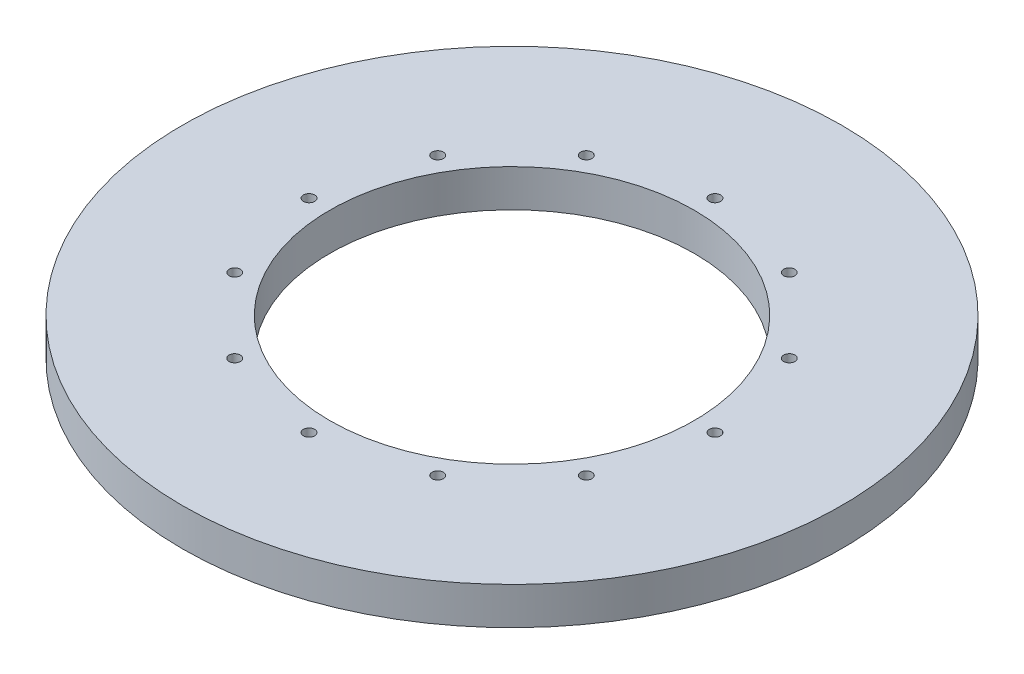
ISO-10303-21;
HEADER;
FILE_DESCRIPTION(('STEP AP214'),'2;1');
FILE_NAME('part.step','',(''),(''),'','','');
FILE_SCHEMA(('AUTOMOTIVE_DESIGN { 1 0 10303 214 1 1 1 1 }'));
ENDSEC;
DATA;
#1=APPLICATION_CONTEXT('core data for automotive mechanical design processes');
#2=APPLICATION_PROTOCOL_DEFINITION('international standard','automotive_design',2000,#1);
#3=PRODUCT_CONTEXT('',#1,'mechanical');
#4=PRODUCT('Part','Part','',(#3));
#5=PRODUCT_RELATED_PRODUCT_CATEGORY('part','',(#4));
#6=PRODUCT_DEFINITION_FORMATION('','',#4);
#7=PRODUCT_DEFINITION_CONTEXT('part definition',#1,'design');
#8=PRODUCT_DEFINITION('design','',#6,#7);
#9=PRODUCT_DEFINITION_SHAPE('','',#8);
#10=(LENGTH_UNIT() NAMED_UNIT(*) SI_UNIT(.MILLI.,.METRE.));
#11=(NAMED_UNIT(*) PLANE_ANGLE_UNIT() SI_UNIT($,.RADIAN.));
#12=(NAMED_UNIT(*) SI_UNIT($,.STERADIAN.) SOLID_ANGLE_UNIT());
#13=UNCERTAINTY_MEASURE_WITH_UNIT(LENGTH_MEASURE(1.E-05),#10,'distance_accuracy_value','');
#14=(GEOMETRIC_REPRESENTATION_CONTEXT(3) GLOBAL_UNCERTAINTY_ASSIGNED_CONTEXT((#13)) GLOBAL_UNIT_ASSIGNED_CONTEXT((#10,
#11,#12)) REPRESENTATION_CONTEXT('',''));
#15=CARTESIAN_POINT('',(0.,0.,0.));
#16=DIRECTION('',(0.,0.,1.));
#17=DIRECTION('',(1.,0.,0.));
#18=AXIS2_PLACEMENT_3D('',#15,#16,#17);
#19=CARTESIAN_POINT('',(0.,9.525,0.));
#20=DIRECTION('',(0.,-1.,0.));
#21=DIRECTION('',(0.,0.,-1.));
#22=AXIS2_PLACEMENT_3D('',#19,#20,#21);
#23=PLANE('',#22);
#24=CARTESIAN_POINT('',(19.1085055169264,9.525,-89.6302499999999));
#25=DIRECTION('',(0.,1.,0.));
#26=DIRECTION('',(0.86602540378444,0.,0.499999999999998));
#27=AXIS2_PLACEMENT_3D('',#24,#25,#26);
#28=CIRCLE('',#27,1.4351);
#29=CARTESIAN_POINT('',(20.3513385738974,9.525,-88.9126999999999));
#30=VERTEX_POINT('',#29);
#31=EDGE_CURVE('E118',#30,#30,#28,.T.);
#32=ORIENTED_EDGE('',*,*,#31,.F.);
#33=EDGE_LOOP('',(#32));
#34=FACE_BOUND('',#33,.T.);
#35=CARTESIAN_POINT('',(12.192,9.525,-63.8174999999998));
#36=DIRECTION('',(0.,1.,0.));
#37=DIRECTION('',(1.,0.,0.));
#38=AXIS2_PLACEMENT_3D('',#35,#36,#37);
#39=CIRCLE('',#38,1.4351);
#40=CARTESIAN_POINT('',(13.6271,9.525,-63.8174999999998));
#41=VERTEX_POINT('',#40);
#42=EDGE_CURVE('E112',#41,#41,#39,.T.);
#43=ORIENTED_EDGE('',*,*,#42,.F.);
#44=EDGE_LOOP('',(#43));
#45=FACE_BOUND('',#44,.T.);
#46=CARTESIAN_POINT('',(19.1085055169266,9.525,-38.0047499999998));
#47=DIRECTION('',(0.,1.,0.));
#48=DIRECTION('',(0.866025403784436,0.,-0.500000000000004));
#49=AXIS2_PLACEMENT_3D('',#46,#47,#48);
#50=CIRCLE('',#49,1.4351);
#51=CARTESIAN_POINT('',(20.3513385738976,9.525,-38.7222999999998));
#52=VERTEX_POINT('',#51);
#53=EDGE_CURVE('E106',#52,#52,#50,.T.);
#54=ORIENTED_EDGE('',*,*,#53,.F.);
#55=EDGE_LOOP('',(#54));
#56=FACE_BOUND('',#55,.T.);
#57=CARTESIAN_POINT('',(38.0047500000003,9.525,-19.1085055169263));
#58=DIRECTION('',(0.,1.,0.));
#59=DIRECTION('',(0.499999999999995,0.,-0.866025403784442));
#60=AXIS2_PLACEMENT_3D('',#57,#58,#59);
#61=CIRCLE('',#60,1.4351);
#62=CARTESIAN_POINT('',(38.7223000000002,9.525,-20.3513385738974));
#63=VERTEX_POINT('',#62);
#64=EDGE_CURVE('E100',#63,#63,#61,.T.);
#65=ORIENTED_EDGE('',*,*,#64,.F.);
#66=EDGE_LOOP('',(#65));
#67=FACE_BOUND('',#66,.T.);
#68=CARTESIAN_POINT('',(63.8175,9.525,-12.192));
#69=DIRECTION('',(0.,1.,0.));
#70=DIRECTION('',(0.,0.,-1.));
#71=AXIS2_PLACEMENT_3D('',#68,#69,#70);
#72=CIRCLE('',#71,1.4351);
#73=CARTESIAN_POINT('',(63.8175,9.525,-13.6271));
#74=VERTEX_POINT('',#73);
#75=EDGE_CURVE('E94',#74,#74,#72,.T.);
#76=ORIENTED_EDGE('',*,*,#75,.F.);
#77=EDGE_LOOP('',(#76));
#78=FACE_BOUND('',#77,.T.);
#79=CARTESIAN_POINT('',(89.6302500000004,9.525,-19.1085055169267));
#80=DIRECTION('',(0.,1.,0.));
#81=DIRECTION('',(-0.500000000000007,0.,-0.866025403784435));
#82=AXIS2_PLACEMENT_3D('',#79,#80,#81);
#83=CIRCLE('',#82,1.4351);
#84=CARTESIAN_POINT('',(88.9127000000003,9.525,-20.3513385738977));
#85=VERTEX_POINT('',#84);
#86=EDGE_CURVE('E88',#85,#85,#83,.T.);
#87=ORIENTED_EDGE('',*,*,#86,.F.);
#88=EDGE_LOOP('',(#87));
#89=FACE_BOUND('',#88,.T.);
#90=CARTESIAN_POINT('',(108.526494483074,9.525,-38.0047500000004));
#91=DIRECTION('',(0.,1.,0.));
#92=DIRECTION('',(-0.866025403784443,0.,-0.499999999999992));
#93=AXIS2_PLACEMENT_3D('',#90,#91,#92);
#94=CIRCLE('',#93,1.4351);
#95=CARTESIAN_POINT('',(107.283661426103,9.525,-38.7223000000004));
#96=VERTEX_POINT('',#95);
#97=EDGE_CURVE('E82',#96,#96,#94,.T.);
#98=ORIENTED_EDGE('',*,*,#97,.F.);
#99=EDGE_LOOP('',(#98));
#100=FACE_BOUND('',#99,.T.);
#101=CARTESIAN_POINT('',(115.443,9.525,-63.8175000000006));
#102=DIRECTION('',(0.,1.,0.));
#103=DIRECTION('',(-1.,0.,0.));
#104=AXIS2_PLACEMENT_3D('',#101,#102,#103);
#105=CIRCLE('',#104,1.4351);
#106=CARTESIAN_POINT('',(114.0079,9.525,-63.8175000000005));
#107=VERTEX_POINT('',#106);
#108=EDGE_CURVE('E75',#107,#107,#105,.T.);
#109=ORIENTED_EDGE('',*,*,#108,.F.);
#110=EDGE_LOOP('',(#109));
#111=FACE_BOUND('',#110,.T.);
#112=CARTESIAN_POINT('',(108.526494483073,9.525,-89.6302500000005));
#113=DIRECTION('',(0.,1.,0.));
#114=DIRECTION('',(-0.866025403784433,0.,0.50000000000001));
#115=AXIS2_PLACEMENT_3D('',#112,#113,#114);
#116=CIRCLE('',#115,1.4351);
#117=CARTESIAN_POINT('',(107.283661426102,9.525,-88.9127000000005));
#118=VERTEX_POINT('',#117);
#119=EDGE_CURVE('E129',#118,#118,#116,.T.);
#120=ORIENTED_EDGE('',*,*,#119,.F.);
#121=EDGE_LOOP('',(#120));
#122=FACE_BOUND('',#121,.T.);
#123=CARTESIAN_POINT('',(89.6302499999994,9.525,-108.526494483074));
#124=DIRECTION('',(0.,1.,0.));
#125=DIRECTION('',(-0.499999999999989,0.,0.866025403784445));
#126=AXIS2_PLACEMENT_3D('',#123,#124,#125);
#127=CIRCLE('',#126,1.4351);
#128=CARTESIAN_POINT('',(88.9126999999994,9.525,-107.283661426103));
#129=VERTEX_POINT('',#128);
#130=EDGE_CURVE('E123',#129,#129,#127,.T.);
#131=ORIENTED_EDGE('',*,*,#130,.F.);
#132=EDGE_LOOP('',(#131));
#133=FACE_BOUND('',#132,.T.);
#134=CARTESIAN_POINT('',(38.0047499999999,9.525,-108.526494483073));
#135=DIRECTION('',(0.,1.,0.));
#136=DIRECTION('',(0.500000000000001,0.,0.866025403784438));
#137=AXIS2_PLACEMENT_3D('',#134,#135,#136);
#138=CIRCLE('',#137,1.4351);
#139=CARTESIAN_POINT('',(38.7222999999999,9.525,-107.283661426102));
#140=VERTEX_POINT('',#139);
#141=EDGE_CURVE('E69',#140,#140,#138,.T.);
#142=ORIENTED_EDGE('',*,*,#141,.F.);
#143=EDGE_LOOP('',(#142));
#144=FACE_BOUND('',#143,.T.);
#145=CARTESIAN_POINT('',(63.8175,9.525,-115.443));
#146=DIRECTION('',(0.,1.,0.));
#147=DIRECTION('',(0.,0.,1.));
#148=AXIS2_PLACEMENT_3D('',#145,#146,#147);
#149=CIRCLE('',#148,1.4351);
#150=CARTESIAN_POINT('',(63.8175,9.525,-114.0079));
#151=VERTEX_POINT('',#150);
#152=EDGE_CURVE('E63',#151,#151,#149,.T.);
#153=ORIENTED_EDGE('',*,*,#152,.F.);
#154=EDGE_LOOP('',(#153));
#155=FACE_BOUND('',#154,.T.);
#156=CARTESIAN_POINT('',(63.8175,9.525,-63.8175));
#157=DIRECTION('',(0.,1.,0.));
#158=DIRECTION('',(0.,0.,1.));
#159=AXIS2_PLACEMENT_3D('',#156,#157,#158);
#160=CIRCLE('',#159,46.355);
#161=CARTESIAN_POINT('',(63.8175,9.525,-17.4625));
#162=VERTEX_POINT('',#161);
#163=EDGE_CURVE('E57',#162,#162,#160,.T.);
#164=ORIENTED_EDGE('',*,*,#163,.F.);
#165=EDGE_LOOP('',(#164));
#166=FACE_BOUND('',#165,.T.);
#167=CARTESIAN_POINT('',(63.8175,9.52500000000001,-63.8175));
#168=DIRECTION('',(0.,-1.,0.));
#169=DIRECTION('',(0.,0.,-1.));
#170=AXIS2_PLACEMENT_3D('',#167,#168,#169);
#171=CIRCLE('',#170,83.82);
#172=CARTESIAN_POINT('',(63.8175,9.52500000000001,-147.6375));
#173=VERTEX_POINT('',#172);
#174=EDGE_CURVE('E11',#173,#173,#171,.F.);
#175=ORIENTED_EDGE('',*,*,#174,.T.);
#176=EDGE_LOOP('',(#175));
#177=FACE_BOUND('',#176,.T.);
#178=ADVANCED_FACE('F42',(#34,#45,#56,#67,#78,#89,#100,#111,#122,#133,#144,#155,#166,#177),#23,.F.);
#179=CARTESIAN_POINT('',(0.,0.,0.));
#180=DIRECTION('',(0.,-1.,0.));
#181=DIRECTION('',(0.,0.,-1.));
#182=AXIS2_PLACEMENT_3D('',#179,#180,#181);
#183=PLANE('',#182);
#184=CARTESIAN_POINT('',(19.1085055169264,0.,-89.6302499999999));
#185=DIRECTION('',(0.,1.,0.));
#186=DIRECTION('',(0.86602540378444,0.,0.499999999999998));
#187=AXIS2_PLACEMENT_3D('',#184,#185,#186);
#188=CIRCLE('',#187,1.4351);
#189=CARTESIAN_POINT('',(20.3513385738974,0.,-88.9126999999999));
#190=VERTEX_POINT('',#189);
#191=EDGE_CURVE('E72',#190,#190,#188,.T.);
#192=ORIENTED_EDGE('',*,*,#191,.T.);
#193=EDGE_LOOP('',(#192));
#194=FACE_BOUND('',#193,.T.);
#195=CARTESIAN_POINT('',(12.192,0.,-63.8174999999998));
#196=DIRECTION('',(0.,1.,0.));
#197=DIRECTION('',(1.,0.,0.));
#198=AXIS2_PLACEMENT_3D('',#195,#196,#197);
#199=CIRCLE('',#198,1.4351);
#200=CARTESIAN_POINT('',(13.6271,0.,-63.8174999999998));
#201=VERTEX_POINT('',#200);
#202=EDGE_CURVE('E115',#201,#201,#199,.T.);
#203=ORIENTED_EDGE('',*,*,#202,.T.);
#204=EDGE_LOOP('',(#203));
#205=FACE_BOUND('',#204,.T.);
#206=CARTESIAN_POINT('',(19.1085055169266,0.,-38.0047499999998));
#207=DIRECTION('',(0.,1.,0.));
#208=DIRECTION('',(0.866025403784436,0.,-0.500000000000004));
#209=AXIS2_PLACEMENT_3D('',#206,#207,#208);
#210=CIRCLE('',#209,1.4351);
#211=CARTESIAN_POINT('',(20.3513385738976,0.,-38.7222999999998));
#212=VERTEX_POINT('',#211);
#213=EDGE_CURVE('E109',#212,#212,#210,.T.);
#214=ORIENTED_EDGE('',*,*,#213,.T.);
#215=EDGE_LOOP('',(#214));
#216=FACE_BOUND('',#215,.T.);
#217=CARTESIAN_POINT('',(38.0047500000003,0.,-19.1085055169263));
#218=DIRECTION('',(0.,1.,0.));
#219=DIRECTION('',(0.499999999999995,0.,-0.866025403784442));
#220=AXIS2_PLACEMENT_3D('',#217,#218,#219);
#221=CIRCLE('',#220,1.4351);
#222=CARTESIAN_POINT('',(38.7223000000002,0.,-20.3513385738974));
#223=VERTEX_POINT('',#222);
#224=EDGE_CURVE('E103',#223,#223,#221,.T.);
#225=ORIENTED_EDGE('',*,*,#224,.T.);
#226=EDGE_LOOP('',(#225));
#227=FACE_BOUND('',#226,.T.);
#228=CARTESIAN_POINT('',(63.8175,0.,-12.192));
#229=DIRECTION('',(0.,1.,0.));
#230=DIRECTION('',(0.,0.,-1.));
#231=AXIS2_PLACEMENT_3D('',#228,#229,#230);
#232=CIRCLE('',#231,1.4351);
#233=CARTESIAN_POINT('',(63.8175,0.,-13.6271));
#234=VERTEX_POINT('',#233);
#235=EDGE_CURVE('E97',#234,#234,#232,.T.);
#236=ORIENTED_EDGE('',*,*,#235,.T.);
#237=EDGE_LOOP('',(#236));
#238=FACE_BOUND('',#237,.T.);
#239=CARTESIAN_POINT('',(89.6302500000004,0.,-19.1085055169267));
#240=DIRECTION('',(0.,1.,0.));
#241=DIRECTION('',(-0.500000000000007,0.,-0.866025403784435));
#242=AXIS2_PLACEMENT_3D('',#239,#240,#241);
#243=CIRCLE('',#242,1.4351);
#244=CARTESIAN_POINT('',(88.9127000000003,0.,-20.3513385738977));
#245=VERTEX_POINT('',#244);
#246=EDGE_CURVE('E91',#245,#245,#243,.T.);
#247=ORIENTED_EDGE('',*,*,#246,.T.);
#248=EDGE_LOOP('',(#247));
#249=FACE_BOUND('',#248,.T.);
#250=CARTESIAN_POINT('',(108.526494483074,0.,-38.0047500000004));
#251=DIRECTION('',(0.,1.,0.));
#252=DIRECTION('',(-0.866025403784443,0.,-0.499999999999992));
#253=AXIS2_PLACEMENT_3D('',#250,#251,#252);
#254=CIRCLE('',#253,1.4351);
#255=CARTESIAN_POINT('',(107.283661426103,0.,-38.7223000000004));
#256=VERTEX_POINT('',#255);
#257=EDGE_CURVE('E85',#256,#256,#254,.T.);
#258=ORIENTED_EDGE('',*,*,#257,.T.);
#259=EDGE_LOOP('',(#258));
#260=FACE_BOUND('',#259,.T.);
#261=CARTESIAN_POINT('',(115.443,0.,-63.8175000000006));
#262=DIRECTION('',(0.,1.,0.));
#263=DIRECTION('',(-1.,0.,0.));
#264=AXIS2_PLACEMENT_3D('',#261,#262,#263);
#265=CIRCLE('',#264,1.4351);
#266=CARTESIAN_POINT('',(114.0079,0.,-63.8175000000005));
#267=VERTEX_POINT('',#266);
#268=EDGE_CURVE('E78',#267,#267,#265,.T.);
#269=ORIENTED_EDGE('',*,*,#268,.T.);
#270=EDGE_LOOP('',(#269));
#271=FACE_BOUND('',#270,.T.);
#272=CARTESIAN_POINT('',(108.526494483073,0.,-89.6302500000005));
#273=DIRECTION('',(0.,1.,0.));
#274=DIRECTION('',(-0.866025403784433,0.,0.50000000000001));
#275=AXIS2_PLACEMENT_3D('',#272,#273,#274);
#276=CIRCLE('',#275,1.4351);
#277=CARTESIAN_POINT('',(107.283661426102,0.,-88.9127000000005));
#278=VERTEX_POINT('',#277);
#279=EDGE_CURVE('E79',#278,#278,#276,.T.);
#280=ORIENTED_EDGE('',*,*,#279,.T.);
#281=EDGE_LOOP('',(#280));
#282=FACE_BOUND('',#281,.T.);
#283=CARTESIAN_POINT('',(89.6302499999994,0.,-108.526494483074));
#284=DIRECTION('',(0.,1.,0.));
#285=DIRECTION('',(-0.499999999999989,0.,0.866025403784445));
#286=AXIS2_PLACEMENT_3D('',#283,#284,#285);
#287=CIRCLE('',#286,1.4351);
#288=CARTESIAN_POINT('',(88.9126999999994,0.,-107.283661426103));
#289=VERTEX_POINT('',#288);
#290=EDGE_CURVE('E126',#289,#289,#287,.T.);
#291=ORIENTED_EDGE('',*,*,#290,.T.);
#292=EDGE_LOOP('',(#291));
#293=FACE_BOUND('',#292,.T.);
#294=CARTESIAN_POINT('',(38.0047499999999,0.,-108.526494483073));
#295=DIRECTION('',(0.,1.,0.));
#296=DIRECTION('',(0.500000000000001,0.,0.866025403784438));
#297=AXIS2_PLACEMENT_3D('',#294,#295,#296);
#298=CIRCLE('',#297,1.4351);
#299=CARTESIAN_POINT('',(38.7222999999999,0.,-107.283661426102));
#300=VERTEX_POINT('',#299);
#301=EDGE_CURVE('E66',#300,#300,#298,.T.);
#302=ORIENTED_EDGE('',*,*,#301,.T.);
#303=EDGE_LOOP('',(#302));
#304=FACE_BOUND('',#303,.T.);
#305=CARTESIAN_POINT('',(63.8175,0.,-115.443));
#306=DIRECTION('',(0.,1.,0.));
#307=DIRECTION('',(0.,0.,1.));
#308=AXIS2_PLACEMENT_3D('',#305,#306,#307);
#309=CIRCLE('',#308,1.4351);
#310=CARTESIAN_POINT('',(63.8175,0.,-114.0079));
#311=VERTEX_POINT('',#310);
#312=EDGE_CURVE('E61',#311,#311,#309,.T.);
#313=ORIENTED_EDGE('',*,*,#312,.T.);
#314=EDGE_LOOP('',(#313));
#315=FACE_BOUND('',#314,.T.);
#316=CARTESIAN_POINT('',(63.8175,0.,-63.8175));
#317=DIRECTION('',(0.,1.,0.));
#318=DIRECTION('',(0.,0.,1.));
#319=AXIS2_PLACEMENT_3D('',#316,#317,#318);
#320=CIRCLE('',#319,46.355);
#321=CARTESIAN_POINT('',(63.8175,0.,-17.4625));
#322=VERTEX_POINT('',#321);
#323=EDGE_CURVE('E53',#322,#322,#320,.T.);
#324=ORIENTED_EDGE('',*,*,#323,.T.);
#325=EDGE_LOOP('',(#324));
#326=FACE_BOUND('',#325,.T.);
#327=CARTESIAN_POINT('',(63.8175,0.,-63.8175));
#328=DIRECTION('',(0.,-1.,0.));
#329=DIRECTION('',(0.,0.,-1.));
#330=AXIS2_PLACEMENT_3D('',#327,#328,#329);
#331=CIRCLE('',#330,83.82);
#332=CARTESIAN_POINT('',(63.8175,0.,-147.6375));
#333=VERTEX_POINT('',#332);
#334=EDGE_CURVE('E49',#333,#333,#331,.T.);
#335=ORIENTED_EDGE('',*,*,#334,.T.);
#336=EDGE_LOOP('',(#335));
#337=FACE_BOUND('',#336,.T.);
#338=ADVANCED_FACE('F44',(#194,#205,#216,#227,#238,#249,#260,#271,#282,#293,#304,#315,#326,
#337),#183,.T.);
#339=CARTESIAN_POINT('',(63.8175,246.603761596226,-63.8175));
#340=DIRECTION('',(0.,-1.,0.));
#341=DIRECTION('',(0.,0.,-1.));
#342=AXIS2_PLACEMENT_3D('',#339,#340,#341);
#343=CYLINDRICAL_SURFACE('',#342,83.82);
#344=ORIENTED_EDGE('',*,*,#334,.F.);
#345=EDGE_LOOP('',(#344));
#346=FACE_BOUND('',#345,.T.);
#347=ORIENTED_EDGE('',*,*,#174,.F.);
#348=EDGE_LOOP('',(#347));
#349=FACE_BOUND('',#348,.T.);
#350=ADVANCED_FACE('F159',(#346,#349),#343,.T.);
#351=CARTESIAN_POINT('',(63.8175,0.,-63.8175));
#352=DIRECTION('',(0.,1.,0.));
#353=DIRECTION('',(0.,0.,1.));
#354=AXIS2_PLACEMENT_3D('',#351,#352,#353);
#355=CYLINDRICAL_SURFACE('',#354,46.355);
#356=ORIENTED_EDGE('',*,*,#323,.F.);
#357=EDGE_LOOP('',(#356));
#358=FACE_BOUND('',#357,.T.);
#359=ORIENTED_EDGE('',*,*,#163,.T.);
#360=EDGE_LOOP('',(#359));
#361=FACE_BOUND('',#360,.T.);
#362=ADVANCED_FACE('F156',(#358,#361),#355,.F.);
#363=CARTESIAN_POINT('',(63.8175,0.,-115.443));
#364=DIRECTION('',(0.,1.,0.));
#365=DIRECTION('',(0.,0.,1.));
#366=AXIS2_PLACEMENT_3D('',#363,#364,#365);
#367=CYLINDRICAL_SURFACE('',#366,1.4351);
#368=ORIENTED_EDGE('',*,*,#312,.F.);
#369=EDGE_LOOP('',(#368));
#370=FACE_BOUND('',#369,.T.);
#371=ORIENTED_EDGE('',*,*,#152,.T.);
#372=EDGE_LOOP('',(#371));
#373=FACE_BOUND('',#372,.T.);
#374=ADVANCED_FACE('F158',(#370,#373),#367,.F.);
#375=CARTESIAN_POINT('',(38.0047499999999,0.,-108.526494483073));
#376=DIRECTION('',(0.,1.,0.));
#377=DIRECTION('',(0.,0.,1.));
#378=AXIS2_PLACEMENT_3D('',#375,#376,#377);
#379=CYLINDRICAL_SURFACE('',#378,1.4351);
#380=ORIENTED_EDGE('',*,*,#301,.F.);
#381=EDGE_LOOP('',(#380));
#382=FACE_BOUND('',#381,.T.);
#383=ORIENTED_EDGE('',*,*,#141,.T.);
#384=EDGE_LOOP('',(#383));
#385=FACE_BOUND('',#384,.T.);
#386=ADVANCED_FACE('F166',(#382,#385),#379,.F.);
#387=CARTESIAN_POINT('',(89.6302499999994,0.,-108.526494483074));
#388=DIRECTION('',(0.,1.,0.));
#389=DIRECTION('',(0.,0.,1.));
#390=AXIS2_PLACEMENT_3D('',#387,#388,#389);
#391=CYLINDRICAL_SURFACE('',#390,1.4351);
#392=ORIENTED_EDGE('',*,*,#290,.F.);
#393=EDGE_LOOP('',(#392));
#394=FACE_BOUND('',#393,.T.);
#395=ORIENTED_EDGE('',*,*,#130,.T.);
#396=EDGE_LOOP('',(#395));
#397=FACE_BOUND('',#396,.T.);
#398=ADVANCED_FACE('F141',(#394,#397),#391,.F.);
#399=CARTESIAN_POINT('',(108.526494483073,0.,-89.6302500000005));
#400=DIRECTION('',(0.,1.,0.));
#401=DIRECTION('',(0.,0.,1.));
#402=AXIS2_PLACEMENT_3D('',#399,#400,#401);
#403=CYLINDRICAL_SURFACE('',#402,1.4351);
#404=ORIENTED_EDGE('',*,*,#279,.F.);
#405=EDGE_LOOP('',(#404));
#406=FACE_BOUND('',#405,.T.);
#407=ORIENTED_EDGE('',*,*,#119,.T.);
#408=EDGE_LOOP('',(#407));
#409=FACE_BOUND('',#408,.T.);
#410=ADVANCED_FACE('F137',(#406,#409),#403,.F.);
#411=CARTESIAN_POINT('',(115.443,0.,-63.8175000000006));
#412=DIRECTION('',(0.,1.,0.));
#413=DIRECTION('',(0.,0.,1.));
#414=AXIS2_PLACEMENT_3D('',#411,#412,#413);
#415=CYLINDRICAL_SURFACE('',#414,1.4351);
#416=ORIENTED_EDGE('',*,*,#268,.F.);
#417=EDGE_LOOP('',(#416));
#418=FACE_BOUND('',#417,.T.);
#419=ORIENTED_EDGE('',*,*,#108,.T.);
#420=EDGE_LOOP('',(#419));
#421=FACE_BOUND('',#420,.T.);
#422=ADVANCED_FACE('F140',(#418,#421),#415,.F.);
#423=CARTESIAN_POINT('',(108.526494483074,0.,-38.0047500000004));
#424=DIRECTION('',(0.,1.,0.));
#425=DIRECTION('',(0.,0.,1.));
#426=AXIS2_PLACEMENT_3D('',#423,#424,#425);
#427=CYLINDRICAL_SURFACE('',#426,1.4351);
#428=ORIENTED_EDGE('',*,*,#257,.F.);
#429=EDGE_LOOP('',(#428));
#430=FACE_BOUND('',#429,.T.);
#431=ORIENTED_EDGE('',*,*,#97,.T.);
#432=EDGE_LOOP('',(#431));
#433=FACE_BOUND('',#432,.T.);
#434=ADVANCED_FACE('F178',(#430,#433),#427,.F.);
#435=CARTESIAN_POINT('',(89.6302500000004,0.,-19.1085055169267));
#436=DIRECTION('',(0.,1.,0.));
#437=DIRECTION('',(0.,0.,1.));
#438=AXIS2_PLACEMENT_3D('',#435,#436,#437);
#439=CYLINDRICAL_SURFACE('',#438,1.4351);
#440=ORIENTED_EDGE('',*,*,#246,.F.);
#441=EDGE_LOOP('',(#440));
#442=FACE_BOUND('',#441,.T.);
#443=ORIENTED_EDGE('',*,*,#86,.T.);
#444=EDGE_LOOP('',(#443));
#445=FACE_BOUND('',#444,.T.);
#446=ADVANCED_FACE('F182',(#442,#445),#439,.F.);
#447=CARTESIAN_POINT('',(63.8175,0.,-12.192));
#448=DIRECTION('',(0.,1.,0.));
#449=DIRECTION('',(0.,0.,1.));
#450=AXIS2_PLACEMENT_3D('',#447,#448,#449);
#451=CYLINDRICAL_SURFACE('',#450,1.4351);
#452=ORIENTED_EDGE('',*,*,#235,.F.);
#453=EDGE_LOOP('',(#452));
#454=FACE_BOUND('',#453,.T.);
#455=ORIENTED_EDGE('',*,*,#75,.T.);
#456=EDGE_LOOP('',(#455));
#457=FACE_BOUND('',#456,.T.);
#458=ADVANCED_FACE('F186',(#454,#457),#451,.F.);
#459=CARTESIAN_POINT('',(38.0047500000003,0.,-19.1085055169263));
#460=DIRECTION('',(0.,1.,0.));
#461=DIRECTION('',(0.,0.,1.));
#462=AXIS2_PLACEMENT_3D('',#459,#460,#461);
#463=CYLINDRICAL_SURFACE('',#462,1.4351);
#464=ORIENTED_EDGE('',*,*,#224,.F.);
#465=EDGE_LOOP('',(#464));
#466=FACE_BOUND('',#465,.T.);
#467=ORIENTED_EDGE('',*,*,#64,.T.);
#468=EDGE_LOOP('',(#467));
#469=FACE_BOUND('',#468,.T.);
#470=ADVANCED_FACE('F190',(#466,#469),#463,.F.);
#471=CARTESIAN_POINT('',(19.1085055169266,0.,-38.0047499999998));
#472=DIRECTION('',(0.,1.,0.));
#473=DIRECTION('',(0.,0.,1.));
#474=AXIS2_PLACEMENT_3D('',#471,#472,#473);
#475=CYLINDRICAL_SURFACE('',#474,1.4351);
#476=ORIENTED_EDGE('',*,*,#213,.F.);
#477=EDGE_LOOP('',(#476));
#478=FACE_BOUND('',#477,.T.);
#479=ORIENTED_EDGE('',*,*,#53,.T.);
#480=EDGE_LOOP('',(#479));
#481=FACE_BOUND('',#480,.T.);
#482=ADVANCED_FACE('F194',(#478,#481),#475,.F.);
#483=CARTESIAN_POINT('',(12.192,0.,-63.8174999999998));
#484=DIRECTION('',(0.,1.,0.));
#485=DIRECTION('',(0.,0.,1.));
#486=AXIS2_PLACEMENT_3D('',#483,#484,#485);
#487=CYLINDRICAL_SURFACE('',#486,1.4351);
#488=ORIENTED_EDGE('',*,*,#202,.F.);
#489=EDGE_LOOP('',(#488));
#490=FACE_BOUND('',#489,.T.);
#491=ORIENTED_EDGE('',*,*,#42,.T.);
#492=EDGE_LOOP('',(#491));
#493=FACE_BOUND('',#492,.T.);
#494=ADVANCED_FACE('F198',(#490,#493),#487,.F.);
#495=CARTESIAN_POINT('',(19.1085055169264,0.,-89.6302499999999));
#496=DIRECTION('',(0.,1.,0.));
#497=DIRECTION('',(0.,0.,1.));
#498=AXIS2_PLACEMENT_3D('',#495,#496,#497);
#499=CYLINDRICAL_SURFACE('',#498,1.4351);
#500=ORIENTED_EDGE('',*,*,#191,.F.);
#501=EDGE_LOOP('',(#500));
#502=FACE_BOUND('',#501,.T.);
#503=ORIENTED_EDGE('',*,*,#31,.T.);
#504=EDGE_LOOP('',(#503));
#505=FACE_BOUND('',#504,.T.);
#506=ADVANCED_FACE('F202',(#502,#505),#499,.F.);
#507=CLOSED_SHELL('',(#178,#338,#350,#362,#374,#386,#398,#410,#422,#434,#446,#458,#470,#482,
#494,#506));
#508=MANIFOLD_SOLID_BREP('B2',#507);
#509=ADVANCED_BREP_SHAPE_REPRESENTATION('',(#18,#508),#14);
#510=SHAPE_DEFINITION_REPRESENTATION(#9,#509);
ENDSEC;
END-ISO-10303-21;
